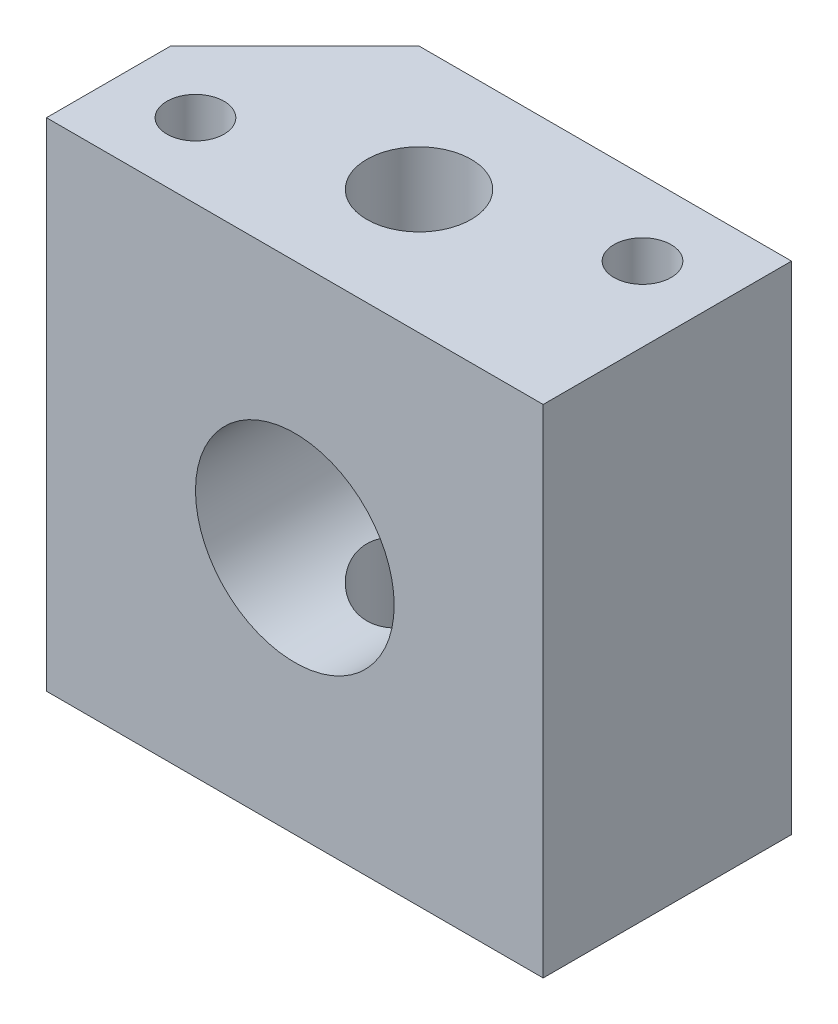
ISO-10303-21;
HEADER;
FILE_DESCRIPTION(('STEP AP214'),'2;1');
FILE_NAME('part.step','',(''),(''),'','','');
FILE_SCHEMA(('AUTOMOTIVE_DESIGN { 1 0 10303 214 1 1 1 1 }'));
ENDSEC;
DATA;
#1=APPLICATION_CONTEXT('core data for automotive mechanical design processes');
#2=APPLICATION_PROTOCOL_DEFINITION('international standard','automotive_design',2000,#1);
#3=PRODUCT_CONTEXT('',#1,'mechanical');
#4=PRODUCT('Part','Part','',(#3));
#5=PRODUCT_RELATED_PRODUCT_CATEGORY('part','',(#4));
#6=PRODUCT_DEFINITION_FORMATION('','',#4);
#7=PRODUCT_DEFINITION_CONTEXT('part definition',#1,'design');
#8=PRODUCT_DEFINITION('design','',#6,#7);
#9=PRODUCT_DEFINITION_SHAPE('','',#8);
#10=(LENGTH_UNIT() NAMED_UNIT(*) SI_UNIT(.MILLI.,.METRE.));
#11=(NAMED_UNIT(*) PLANE_ANGLE_UNIT() SI_UNIT($,.RADIAN.));
#12=(NAMED_UNIT(*) SI_UNIT($,.STERADIAN.) SOLID_ANGLE_UNIT());
#13=UNCERTAINTY_MEASURE_WITH_UNIT(LENGTH_MEASURE(1.E-05),#10,'distance_accuracy_value','');
#14=(GEOMETRIC_REPRESENTATION_CONTEXT(3) GLOBAL_UNCERTAINTY_ASSIGNED_CONTEXT((#13)) GLOBAL_UNIT_ASSIGNED_CONTEXT((#10,
#11,#12)) REPRESENTATION_CONTEXT('',''));
#15=CARTESIAN_POINT('',(0.,0.,0.));
#16=DIRECTION('',(0.,0.,1.));
#17=DIRECTION('',(1.,0.,0.));
#18=AXIS2_PLACEMENT_3D('',#15,#16,#17);
#19=CARTESIAN_POINT('',(0.,0.,10.));
#20=DIRECTION('',(0.,0.,-1.));
#21=DIRECTION('',(-1.,0.,0.));
#22=AXIS2_PLACEMENT_3D('',#19,#20,#21);
#23=PLANE('',#22);
#24=DIRECTION('',(0.,-1.,0.));
#25=VECTOR('',#24,1.);
#26=CARTESIAN_POINT('',(0.,0.,10.));
#27=LINE('',#26,#25);
#28=CARTESIAN_POINT('',(0.,20.,10.));
#29=VERTEX_POINT('',#28);
#30=CARTESIAN_POINT('',(0.,0.,10.));
#31=VERTEX_POINT('',#30);
#32=EDGE_CURVE('E94',#29,#31,#27,.T.);
#33=ORIENTED_EDGE('',*,*,#32,.T.);
#34=DIRECTION('',(1.,0.,0.));
#35=VECTOR('',#34,1.);
#36=CARTESIAN_POINT('',(0.,0.,10.));
#37=LINE('',#36,#35);
#38=CARTESIAN_POINT('',(20.,0.,10.));
#39=VERTEX_POINT('',#38);
#40=EDGE_CURVE('E83',#31,#39,#37,.T.);
#41=ORIENTED_EDGE('',*,*,#40,.T.);
#42=DIRECTION('',(0.,1.,0.));
#43=VECTOR('',#42,1.);
#44=CARTESIAN_POINT('',(20.,0.,10.));
#45=LINE('',#44,#43);
#46=CARTESIAN_POINT('',(20.,20.,10.));
#47=VERTEX_POINT('',#46);
#48=EDGE_CURVE('E93',#39,#47,#45,.T.);
#49=ORIENTED_EDGE('',*,*,#48,.T.);
#50=DIRECTION('',(-1.,0.,0.));
#51=VECTOR('',#50,1.);
#52=CARTESIAN_POINT('',(0.,20.,10.));
#53=LINE('',#52,#51);
#54=EDGE_CURVE('E99',#47,#29,#53,.T.);
#55=ORIENTED_EDGE('',*,*,#54,.T.);
#56=EDGE_LOOP('',(#33,#41,#49,#55));
#57=FACE_BOUND('',#56,.T.);
#58=CARTESIAN_POINT('',(10.,10.,10.));
#59=DIRECTION('',(0.,0.,1.));
#60=DIRECTION('',(1.,0.,0.));
#61=AXIS2_PLACEMENT_3D('',#58,#59,#60);
#62=CIRCLE('',#61,4.);
#63=CARTESIAN_POINT('',(14.,10.,10.));
#64=VERTEX_POINT('',#63);
#65=EDGE_CURVE('E275',#64,#64,#62,.T.);
#66=ORIENTED_EDGE('',*,*,#65,.F.);
#67=EDGE_LOOP('',(#66));
#68=FACE_BOUND('',#67,.T.);
#69=ADVANCED_FACE('F38',(#57,#68),#23,.F.);
#70=CARTESIAN_POINT('',(0.,0.,0.));
#71=DIRECTION('',(0.,0.,-1.));
#72=DIRECTION('',(-1.,0.,0.));
#73=AXIS2_PLACEMENT_3D('',#70,#71,#72);
#74=PLANE('',#73);
#75=DIRECTION('',(1.,0.,0.));
#76=VECTOR('',#75,1.);
#77=CARTESIAN_POINT('',(0.,0.,0.));
#78=LINE('',#77,#76);
#79=CARTESIAN_POINT('',(5.00000000000002,0.,0.));
#80=VERTEX_POINT('',#79);
#81=CARTESIAN_POINT('',(20.,0.,0.));
#82=VERTEX_POINT('',#81);
#83=EDGE_CURVE('E274',#80,#82,#78,.T.);
#84=ORIENTED_EDGE('',*,*,#83,.F.);
#85=DIRECTION('',(0.,1.,0.));
#86=VECTOR('',#85,1.);
#87=CARTESIAN_POINT('',(5.00000000000002,20.,0.));
#88=LINE('',#87,#86);
#89=CARTESIAN_POINT('',(5.00000000000002,20.,0.));
#90=VERTEX_POINT('',#89);
#91=EDGE_CURVE('E47',#80,#90,#88,.T.);
#92=ORIENTED_EDGE('',*,*,#91,.T.);
#93=DIRECTION('',(-1.,0.,0.));
#94=VECTOR('',#93,1.);
#95=CARTESIAN_POINT('',(0.,20.,0.));
#96=LINE('',#95,#94);
#97=CARTESIAN_POINT('',(20.,20.,0.));
#98=VERTEX_POINT('',#97);
#99=EDGE_CURVE('E104',#98,#90,#96,.T.);
#100=ORIENTED_EDGE('',*,*,#99,.F.);
#101=DIRECTION('',(0.,1.,0.));
#102=VECTOR('',#101,1.);
#103=CARTESIAN_POINT('',(20.,0.,0.));
#104=LINE('',#103,#102);
#105=EDGE_CURVE('E272',#82,#98,#104,.T.);
#106=ORIENTED_EDGE('',*,*,#105,.F.);
#107=EDGE_LOOP('',(#84,#92,#100,#106));
#108=FACE_BOUND('',#107,.T.);
#109=CARTESIAN_POINT('',(10.,10.,0.));
#110=DIRECTION('',(0.,0.,1.));
#111=DIRECTION('',(1.,0.,0.));
#112=AXIS2_PLACEMENT_3D('',#109,#110,#111);
#113=CIRCLE('',#112,4.);
#114=CARTESIAN_POINT('',(14.,10.,0.));
#115=VERTEX_POINT('',#114);
#116=EDGE_CURVE('E279',#115,#115,#113,.T.);
#117=ORIENTED_EDGE('',*,*,#116,.T.);
#118=EDGE_LOOP('',(#117));
#119=FACE_BOUND('',#118,.T.);
#120=ADVANCED_FACE('F158',(#108,#119),#74,.T.);
#121=CARTESIAN_POINT('',(0.,0.,10.));
#122=DIRECTION('',(1.,0.,0.));
#123=DIRECTION('',(0.,0.,-1.));
#124=AXIS2_PLACEMENT_3D('',#121,#122,#123);
#125=PLANE('',#124);
#126=DIRECTION('',(0.,0.,-1.));
#127=VECTOR('',#126,1.);
#128=CARTESIAN_POINT('',(0.,20.,10.));
#129=LINE('',#128,#127);
#130=CARTESIAN_POINT('',(0.,20.,5.));
#131=VERTEX_POINT('',#130);
#132=EDGE_CURVE('E260',#29,#131,#129,.T.);
#133=ORIENTED_EDGE('',*,*,#132,.T.);
#134=DIRECTION('',(0.,-1.,0.));
#135=VECTOR('',#134,1.);
#136=CARTESIAN_POINT('',(0.,0.,5.));
#137=LINE('',#136,#135);
#138=CARTESIAN_POINT('',(0.,0.,5.));
#139=VERTEX_POINT('',#138);
#140=EDGE_CURVE('E109',#131,#139,#137,.T.);
#141=ORIENTED_EDGE('',*,*,#140,.T.);
#142=DIRECTION('',(0.,0.,-1.));
#143=VECTOR('',#142,1.);
#144=CARTESIAN_POINT('',(0.,0.,10.));
#145=LINE('',#144,#143);
#146=EDGE_CURVE('E87',#31,#139,#145,.T.);
#147=ORIENTED_EDGE('',*,*,#146,.F.);
#148=ORIENTED_EDGE('',*,*,#32,.F.);
#149=EDGE_LOOP('',(#133,#141,#147,#148));
#150=FACE_BOUND('',#149,.T.);
#151=ADVANCED_FACE('F107',(#150),#125,.F.);
#152=CARTESIAN_POINT('',(0.,0.,10.));
#153=DIRECTION('',(0.,1.,0.));
#154=DIRECTION('',(0.,0.,1.));
#155=AXIS2_PLACEMENT_3D('',#152,#153,#154);
#156=PLANE('',#155);
#157=CARTESIAN_POINT('',(10.,0.,5.));
#158=DIRECTION('',(0.,1.,0.));
#159=DIRECTION('',(0.,0.,1.));
#160=AXIS2_PLACEMENT_3D('',#157,#158,#159);
#161=CIRCLE('',#160,2.1);
#162=CARTESIAN_POINT('',(10.,0.,7.1));
#163=VERTEX_POINT('',#162);
#164=EDGE_CURVE('E130',#163,#163,#161,.T.);
#165=ORIENTED_EDGE('',*,*,#164,.T.);
#166=EDGE_LOOP('',(#165));
#167=FACE_BOUND('',#166,.T.);
#168=CARTESIAN_POINT('',(17.,0.,3.));
#169=DIRECTION('',(0.,1.,0.));
#170=DIRECTION('',(0.,0.,1.));
#171=AXIS2_PLACEMENT_3D('',#168,#169,#170);
#172=CIRCLE('',#171,1.15);
#173=CARTESIAN_POINT('',(17.,0.,4.15));
#174=VERTEX_POINT('',#173);
#175=EDGE_CURVE('E291',#174,#174,#172,.T.);
#176=ORIENTED_EDGE('',*,*,#175,.T.);
#177=EDGE_LOOP('',(#176));
#178=FACE_BOUND('',#177,.T.);
#179=CARTESIAN_POINT('',(3.,0.,7.));
#180=DIRECTION('',(0.,1.,0.));
#181=DIRECTION('',(0.,0.,1.));
#182=AXIS2_PLACEMENT_3D('',#179,#180,#181);
#183=CIRCLE('',#182,1.15);
#184=CARTESIAN_POINT('',(3.,0.,8.15));
#185=VERTEX_POINT('',#184);
#186=EDGE_CURVE('E283',#185,#185,#183,.T.);
#187=ORIENTED_EDGE('',*,*,#186,.T.);
#188=EDGE_LOOP('',(#187));
#189=FACE_BOUND('',#188,.T.);
#190=ORIENTED_EDGE('',*,*,#146,.T.);
#191=DIRECTION('',(0.707106781186549,0.,-0.707106781186546));
#192=VECTOR('',#191,1.);
#193=CARTESIAN_POINT('',(0.,0.,5.));
#194=LINE('',#193,#192);
#195=EDGE_CURVE('E61',#139,#80,#194,.T.);
#196=ORIENTED_EDGE('',*,*,#195,.T.);
#197=ORIENTED_EDGE('',*,*,#83,.T.);
#198=DIRECTION('',(0.,0.,-1.));
#199=VECTOR('',#198,1.);
#200=CARTESIAN_POINT('',(20.,0.,10.));
#201=LINE('',#200,#199);
#202=EDGE_CURVE('E89',#39,#82,#201,.T.);
#203=ORIENTED_EDGE('',*,*,#202,.F.);
#204=ORIENTED_EDGE('',*,*,#40,.F.);
#205=EDGE_LOOP('',(#190,#196,#197,#203,#204));
#206=FACE_BOUND('',#205,.T.);
#207=ADVANCED_FACE('F85',(#167,#178,#189,#206),#156,.F.);
#208=CARTESIAN_POINT('',(20.,0.,10.));
#209=DIRECTION('',(-1.,0.,0.));
#210=DIRECTION('',(0.,0.,1.));
#211=AXIS2_PLACEMENT_3D('',#208,#209,#210);
#212=PLANE('',#211);
#213=ORIENTED_EDGE('',*,*,#105,.T.);
#214=DIRECTION('',(0.,0.,-1.));
#215=VECTOR('',#214,1.);
#216=CARTESIAN_POINT('',(20.,20.,10.));
#217=LINE('',#216,#215);
#218=EDGE_CURVE('E117',#47,#98,#217,.T.);
#219=ORIENTED_EDGE('',*,*,#218,.F.);
#220=ORIENTED_EDGE('',*,*,#48,.F.);
#221=ORIENTED_EDGE('',*,*,#202,.T.);
#222=EDGE_LOOP('',(#213,#219,#220,#221));
#223=FACE_BOUND('',#222,.T.);
#224=ADVANCED_FACE('F166',(#223),#212,.F.);
#225=CARTESIAN_POINT('',(0.,20.,10.));
#226=DIRECTION('',(0.,-1.,0.));
#227=DIRECTION('',(0.,0.,-1.));
#228=AXIS2_PLACEMENT_3D('',#225,#226,#227);
#229=PLANE('',#228);
#230=CARTESIAN_POINT('',(10.,20.,5.));
#231=DIRECTION('',(0.,1.,0.));
#232=DIRECTION('',(0.,0.,1.));
#233=AXIS2_PLACEMENT_3D('',#230,#231,#232);
#234=CIRCLE('',#233,2.1);
#235=CARTESIAN_POINT('',(10.,20.,7.1));
#236=VERTEX_POINT('',#235);
#237=EDGE_CURVE('E302',#236,#236,#234,.T.);
#238=ORIENTED_EDGE('',*,*,#237,.F.);
#239=EDGE_LOOP('',(#238));
#240=FACE_BOUND('',#239,.T.);
#241=CARTESIAN_POINT('',(17.,20.,3.));
#242=DIRECTION('',(0.,1.,0.));
#243=DIRECTION('',(0.,0.,1.));
#244=AXIS2_PLACEMENT_3D('',#241,#242,#243);
#245=CIRCLE('',#244,1.15);
#246=CARTESIAN_POINT('',(17.,20.,4.15));
#247=VERTEX_POINT('',#246);
#248=EDGE_CURVE('E295',#247,#247,#245,.T.);
#249=ORIENTED_EDGE('',*,*,#248,.F.);
#250=EDGE_LOOP('',(#249));
#251=FACE_BOUND('',#250,.T.);
#252=CARTESIAN_POINT('',(3.,20.,7.));
#253=DIRECTION('',(0.,1.,0.));
#254=DIRECTION('',(0.,0.,1.));
#255=AXIS2_PLACEMENT_3D('',#252,#253,#254);
#256=CIRCLE('',#255,1.15);
#257=CARTESIAN_POINT('',(3.,20.,8.15));
#258=VERTEX_POINT('',#257);
#259=EDGE_CURVE('E287',#258,#258,#256,.T.);
#260=ORIENTED_EDGE('',*,*,#259,.F.);
#261=EDGE_LOOP('',(#260));
#262=FACE_BOUND('',#261,.T.);
#263=ORIENTED_EDGE('',*,*,#99,.T.);
#264=DIRECTION('',(-0.707106781186549,0.,0.707106781186546));
#265=VECTOR('',#264,1.);
#266=CARTESIAN_POINT('',(0.,20.,5.));
#267=LINE('',#266,#265);
#268=EDGE_CURVE('E11',#90,#131,#267,.T.);
#269=ORIENTED_EDGE('',*,*,#268,.T.);
#270=ORIENTED_EDGE('',*,*,#132,.F.);
#271=ORIENTED_EDGE('',*,*,#54,.F.);
#272=ORIENTED_EDGE('',*,*,#218,.T.);
#273=EDGE_LOOP('',(#263,#269,#270,#271,#272));
#274=FACE_BOUND('',#273,.T.);
#275=ADVANCED_FACE('F153',(#240,#251,#262,#274),#229,.F.);
#276=CARTESIAN_POINT('',(10.,10.,10.));
#277=DIRECTION('',(0.,0.,-1.));
#278=DIRECTION('',(-1.,0.,0.));
#279=AXIS2_PLACEMENT_3D('',#276,#277,#278);
#280=CYLINDRICAL_SURFACE('',#279,4.);
#281=CARTESIAN_POINT('',(10.,6.,7.1));
#282=CARTESIAN_POINT('',(10.1097252395222,6.00000735712143,7.09999149182402));
#283=CARTESIAN_POINT('',(10.219566121798,6.00456264372183,7.09134922217854));
#284=CARTESIAN_POINT('',(10.4359563328533,6.02233943440273,7.05717948516372));
#285=CARTESIAN_POINT('',(10.5424999670262,6.03557514127012,7.03162434455593));
#286=CARTESIAN_POINT('',(10.7488477672566,6.06933643737892,6.96492682041999));
#287=CARTESIAN_POINT('',(10.848677088492,6.08983277838819,6.92384693196483));
#288=CARTESIAN_POINT('',(11.0398542926017,6.13627185166547,6.82761268027001));
#289=CARTESIAN_POINT('',(11.1312023073436,6.1622144992337,6.77245853590725));
#290=CARTESIAN_POINT('',(11.309471828917,6.21918036989897,6.64560480379001));
#291=CARTESIAN_POINT('',(11.395724279159,6.2504237366637,6.57306544943579));
#292=CARTESIAN_POINT('',(11.5554650500713,6.31381930334756,6.41532568390628));
#293=CARTESIAN_POINT('',(11.6289425654236,6.34597224613962,6.33011466668524));
#294=CARTESIAN_POINT('',(11.7675321072039,6.41082397725215,6.14052416418154));
#295=CARTESIAN_POINT('',(11.831345969498,6.44332348866761,6.03511911137417));
#296=CARTESIAN_POINT('',(11.940078009522,6.50144007791784,5.81322101259495));
#297=CARTESIAN_POINT('',(11.9850105598362,6.52706238534035,5.69673648353417));
#298=CARTESIAN_POINT('',(12.0516277897332,6.56601687704524,5.4632691019904));
#299=CARTESIAN_POINT('',(12.0745813337518,6.58001266877583,5.34676509569801));
#300=CARTESIAN_POINT('',(12.1004206577409,6.59581278015183,5.11079196134465));
#301=CARTESIAN_POINT('',(12.1033302560727,6.59763156974199,4.99132652193647));
#302=CARTESIAN_POINT('',(12.0899257568675,6.58939436861611,4.77023585900601));
#303=CARTESIAN_POINT('',(12.0761575200203,6.58091060350251,4.66838235315366));
#304=CARTESIAN_POINT('',(12.0342448200542,6.55581083424707,4.46871985136041));
#305=CARTESIAN_POINT('',(12.0060949114543,6.539191749845,4.37091240259461));
#306=CARTESIAN_POINT('',(11.9357620172503,6.49935982662122,4.17933944133553));
#307=CARTESIAN_POINT('',(11.8932738651597,6.476005360057,4.08571682638858));
#308=CARTESIAN_POINT('',(11.795716667553,6.42530822285815,3.90646125445991));
#309=CARTESIAN_POINT('',(11.7406420030435,6.39796377295332,3.82083189002303));
#310=CARTESIAN_POINT('',(11.6103939818052,6.33769555595972,3.64721957759017));
#311=CARTESIAN_POINT('',(11.5334784250171,6.30453027169095,3.5606227305343));
#312=CARTESIAN_POINT('',(11.3661646278118,6.23946073012832,3.40094507949334));
#313=CARTESIAN_POINT('',(11.2757586855825,6.20755720643637,3.32787205014572));
#314=CARTESIAN_POINT('',(11.07766804033,6.14643646739299,3.19341787931535));
#315=CARTESIAN_POINT('',(10.9692989194435,6.11747001525525,3.13292153118831));
#316=CARTESIAN_POINT('',(10.7420234421849,6.06771227404274,3.031537329285));
#317=CARTESIAN_POINT('',(10.6231263407839,6.04691389029545,2.99063245181349));
#318=CARTESIAN_POINT('',(10.3893969746267,6.0174126557382,2.93322732089385));
#319=CARTESIAN_POINT('',(10.2751308230942,6.00780492271699,2.9148930907168));
#320=CARTESIAN_POINT('',(10.0447608666751,5.99859330232608,2.89730685099086));
#321=CARTESIAN_POINT('',(9.9286581079261,5.99898391135607,2.89804434338993));
#322=CARTESIAN_POINT('',(9.70872092144702,6.0092327131638,2.91762725788288));
#323=CARTESIAN_POINT('',(9.60470032451397,6.01826140500287,2.93488622954967));
#324=CARTESIAN_POINT('',(9.40127181780377,6.04373452472691,2.98443875043909));
#325=CARTESIAN_POINT('',(9.30186439595728,6.06017973508651,3.01673388605335));
#326=CARTESIAN_POINT('',(9.10744667267227,6.09955778917673,3.09614425381873));
#327=CARTESIAN_POINT('',(9.01261796662089,6.12264823611772,3.14362307426731));
#328=CARTESIAN_POINT('',(8.83198843397269,6.17317896967193,3.25161917503482));
#329=CARTESIAN_POINT('',(8.74619124866934,6.20062099964834,3.312141684517));
#330=CARTESIAN_POINT('',(8.57644597835234,6.26069150054948,3.45183455389137));
#331=CARTESIAN_POINT('',(8.49364624763825,6.29356175470312,3.53229813881505));
#332=CARTESIAN_POINT('',(8.34215054537142,6.35879793581409,3.70585137885724));
#333=CARTESIAN_POINT('',(8.27346680544534,6.39116340311868,3.79895186895899));
#334=CARTESIAN_POINT('',(8.14802592286797,6.45381708724124,4.00233559015911));
#335=CARTESIAN_POINT('',(8.09227941578299,6.48384996522084,4.1133282356271));
#336=CARTESIAN_POINT('',(8.00083622566024,6.53501441698331,4.34516122596433));
#337=CARTESIAN_POINT('',(7.96511152583645,6.55615841867861,4.46598753776113));
#338=CARTESIAN_POINT('',(7.9182077120598,6.58432664261803,4.70149049526115));
#339=CARTESIAN_POINT('',(7.90496787202061,6.59253060297121,4.81561103123257));
#340=CARTESIAN_POINT('',(7.89735597501305,6.59721867481627,5.04469308443813));
#341=CARTESIAN_POINT('',(7.90297244647974,6.59370991195439,5.1596540479175));
#342=CARTESIAN_POINT('',(7.93094268033587,6.57666719939133,5.37316961432223));
#343=CARTESIAN_POINT('',(7.95130413421546,6.5643284893851,5.47209433551285));
#344=CARTESIAN_POINT('',(8.00554046552531,6.53256392015641,5.66496081401225));
#345=CARTESIAN_POINT('',(8.03942014323663,6.51313554362409,5.75890078781238));
#346=CARTESIAN_POINT('',(8.12217291990849,6.46784460498247,5.94599660125697));
#347=CARTESIAN_POINT('',(8.17188302793889,6.44164384863016,6.03869769157733));
#348=CARTESIAN_POINT('',(8.28402810851478,6.38622716980778,6.21506230921822));
#349=CARTESIAN_POINT('',(8.34646992511577,6.35700962982328,6.29872093850826));
#350=CARTESIAN_POINT('',(8.49243500638422,6.29400539338761,6.46672364713411));
#351=CARTESIAN_POINT('',(8.57768101319548,6.26014701561832,6.54955350976633));
#352=CARTESIAN_POINT('',(8.7616087291921,6.19527738709219,6.70015739194561));
#353=CARTESIAN_POINT('',(8.86029865553674,6.16426789718714,6.76792213623383));
#354=CARTESIAN_POINT('',(9.0712774135892,6.10775536569268,6.88743364904118));
#355=CARTESIAN_POINT('',(9.18379352536369,6.08237123529014,6.93884301060636));
#356=CARTESIAN_POINT('',(9.35889820048832,6.05126254272285,7.00070791315573));
#357=CARTESIAN_POINT('',(9.41828167895052,6.04205787823116,7.01878135698884));
#358=CARTESIAN_POINT('',(9.53872715481943,6.02622292348595,7.04965439112677));
#359=CARTESIAN_POINT('',(9.59978817571371,6.01959116815001,7.06245698304871));
#360=CARTESIAN_POINT('',(9.71722282280003,6.00961465038475,7.08164251076548));
#361=CARTESIAN_POINT('',(9.77349525398962,6.00601882824931,7.08851710911178));
#362=CARTESIAN_POINT('',(9.8865014673951,6.00120957667597,7.09769809925703));
#363=CARTESIAN_POINT('',(9.94323525862547,5.99999619390127,7.1000044015799));
#364=CARTESIAN_POINT('',(10.,6.,7.1));
#365=B_SPLINE_CURVE_WITH_KNOTS('',3,(#281,#282,#283,#284,#285,#286,#287,#288,#289,#290,#291,
#292,#293,#294,#295,#296,#297,#298,#299,#300,#301,#302,#303,#304,#305,#306,#307,#308,#309,#310,
#311,#312,#313,#314,#315,#316,#317,#318,#319,#320,#321,#322,#323,#324,#325,#326,#327,#328,#329,
#330,#331,#332,#333,#334,#335,#336,#337,#338,#339,#340,#341,#342,#343,#344,#345,#346,#347,#348,
#349,#350,#351,#352,#353,#354,#355,#356,#357,#358,#359,#360,#361,#362,#363,#364),.UNSPECIFIED.,
.T.,.F.,(4,2,2,2,2,2,2,2,2,2,2,2,2,2,2,2,2,2,2,2,2,2,2,2,2,2,2,2,2,2,2,2,2,2,2,2,2,2,2,2,2,4),
(0.,0.328955388056856,0.658450355809533,0.986632826787796,1.31481019432105,1.66422610127769,
2.01393612903032,2.3943054227538,2.77438464995628,3.13089429519635,3.48698022433373,
3.79492330354659,4.10298306894291,4.41806287071792,4.73328360921357,5.09317488258761,
5.4532724136417,5.83355153918037,6.21349962504739,6.55994297045685,6.90619561978194,
7.22222027001752,7.53827827001649,7.86255611827312,8.18696421086294,8.54557019619715,
8.90448561862087,9.28577946390602,9.66653841880978,10.0100186118085,10.3532898805348,
10.6572136356427,10.9612454093544,11.2851996834104,11.6093285635883,11.9784125341219,
12.3477231159961,12.7242211787441,12.9122308814787,13.1001333688401,13.270310275105,
13.4404905144749),.UNSPECIFIED.);
#366=CARTESIAN_POINT('',(10.,6.,7.1));
#367=VERTEX_POINT('',#366);
#368=EDGE_CURVE('E129',#367,#367,#365,.T.);
#369=ORIENTED_EDGE('',*,*,#368,.F.);
#370=EDGE_LOOP('',(#369));
#371=FACE_BOUND('',#370,.T.);
#372=CARTESIAN_POINT('',(10.,14.,7.1));
#373=CARTESIAN_POINT('',(9.89027476047782,13.9999926428786,7.09999149182402));
#374=CARTESIAN_POINT('',(9.78043387820201,13.9954373562782,7.09134922217854));
#375=CARTESIAN_POINT('',(9.5640436671467,13.9776605655973,7.05717948516372));
#376=CARTESIAN_POINT('',(9.45750003297383,13.9644248587299,7.03162434455593));
#377=CARTESIAN_POINT('',(9.25115223274336,13.9306635626211,6.96492682041999));
#378=CARTESIAN_POINT('',(9.15132291150798,13.9101672216118,6.92384693196483));
#379=CARTESIAN_POINT('',(8.9601457073983,13.8637281483345,6.82761268027001));
#380=CARTESIAN_POINT('',(8.86879769265641,13.8377855007663,6.77245853590725));
#381=CARTESIAN_POINT('',(8.69052817108305,13.780819630101,6.64560480379001));
#382=CARTESIAN_POINT('',(8.60427572084105,13.7495762633363,6.57306544943579));
#383=CARTESIAN_POINT('',(8.44453494992872,13.6861806966524,6.41532568390628));
#384=CARTESIAN_POINT('',(8.37105743457642,13.6540277538604,6.33011466668524));
#385=CARTESIAN_POINT('',(8.23246789279613,13.5891760227479,6.14052416418154));
#386=CARTESIAN_POINT('',(8.16865403050204,13.5566765113324,6.03511911137417));
#387=CARTESIAN_POINT('',(8.059921990478,13.4985599220822,5.81322101259495));
#388=CARTESIAN_POINT('',(8.01498944016383,13.4729376146597,5.69673648353417));
#389=CARTESIAN_POINT('',(7.94837221026677,13.4339831229548,5.4632691019904));
#390=CARTESIAN_POINT('',(7.92541866624817,13.4199873312242,5.34676509569802));
#391=CARTESIAN_POINT('',(7.8995793422591,13.4041872198482,5.11079196134465));
#392=CARTESIAN_POINT('',(7.89666974392728,13.402368430258,4.99132652193647));
#393=CARTESIAN_POINT('',(7.91007424313252,13.4106056313839,4.77023585900601));
#394=CARTESIAN_POINT('',(7.92384247997974,13.4190893964975,4.66838235315366));
#395=CARTESIAN_POINT('',(7.96575517994578,13.4441891657529,4.46871985136041));
#396=CARTESIAN_POINT('',(7.99390508854568,13.460808250155,4.37091240259461));
#397=CARTESIAN_POINT('',(8.06423798274965,13.5006401733788,4.17933944133553));
#398=CARTESIAN_POINT('',(8.10672613484033,13.523994639943,4.08571682638858));
#399=CARTESIAN_POINT('',(8.20428333244702,13.5746917771419,3.90646125445991));
#400=CARTESIAN_POINT('',(8.25935799695647,13.6020362270467,3.82083189002303));
#401=CARTESIAN_POINT('',(8.38960601819478,13.6623044440403,3.64721957759017));
#402=CARTESIAN_POINT('',(8.46652157498293,13.6954697283091,3.5606227305343));
#403=CARTESIAN_POINT('',(8.63383537218824,13.7605392698717,3.40094507949334));
#404=CARTESIAN_POINT('',(8.72424131441753,13.7924427935636,3.32787205014572));
#405=CARTESIAN_POINT('',(8.92233195967002,13.853563532607,3.19341787931535));
#406=CARTESIAN_POINT('',(9.0307010805565,13.8825299847447,3.13292153118831));
#407=CARTESIAN_POINT('',(9.25797655781514,13.9322877259573,3.031537329285));
#408=CARTESIAN_POINT('',(9.37687365921613,13.9530861097046,2.99063245181349));
#409=CARTESIAN_POINT('',(9.61060302537331,13.9825873442618,2.93322732089385));
#410=CARTESIAN_POINT('',(9.72486917690578,13.992195077283,2.9148930907168));
#411=CARTESIAN_POINT('',(9.95523913332491,14.0014066976739,2.89730685099086));
#412=CARTESIAN_POINT('',(10.0713418920739,14.0010160886439,2.89804434338993));
#413=CARTESIAN_POINT('',(10.291279078553,13.9907672868362,2.91762725788288));
#414=CARTESIAN_POINT('',(10.395299675486,13.9817385949971,2.93488622954967));
#415=CARTESIAN_POINT('',(10.5987281821962,13.9562654752731,2.98443875043909));
#416=CARTESIAN_POINT('',(10.6981356040427,13.9398202649135,3.01673388605335));
#417=CARTESIAN_POINT('',(10.8925533273277,13.9004422108233,3.09614425381873));
#418=CARTESIAN_POINT('',(10.9873820333791,13.8773517638823,3.14362307426731));
#419=CARTESIAN_POINT('',(11.1680115660273,13.8268210303281,3.25161917503482));
#420=CARTESIAN_POINT('',(11.2538087513307,13.7993790003517,3.312141684517));
#421=CARTESIAN_POINT('',(11.4235540216477,13.7393084994505,3.45183455389137));
#422=CARTESIAN_POINT('',(11.5063537523618,13.7064382452969,3.53229813881505));
#423=CARTESIAN_POINT('',(11.6578494546286,13.6412020641859,3.70585137885723));
#424=CARTESIAN_POINT('',(11.7265331945547,13.6088365968813,3.79895186895899));
#425=CARTESIAN_POINT('',(11.851974077132,13.5461829127588,4.00233559015911));
#426=CARTESIAN_POINT('',(11.907720584217,13.5161500347792,4.1133282356271));
#427=CARTESIAN_POINT('',(11.9991637743398,13.4649855830167,4.34516122596433));
#428=CARTESIAN_POINT('',(12.0348884741635,13.4438415813214,4.46598753776113));
#429=CARTESIAN_POINT('',(12.0817922879402,13.415673357382,4.70149049526115));
#430=CARTESIAN_POINT('',(12.0950321279794,13.4074693970288,4.81561103123257));
#431=CARTESIAN_POINT('',(12.102644024987,13.4027813251837,5.04469308443813));
#432=CARTESIAN_POINT('',(12.0970275535203,13.4062900880456,5.1596540479175));
#433=CARTESIAN_POINT('',(12.0690573196641,13.4233328006087,5.37316961432223));
#434=CARTESIAN_POINT('',(12.0486958657845,13.4356715106149,5.47209433551285));
#435=CARTESIAN_POINT('',(11.9944595344747,13.4674360798436,5.66496081401225));
#436=CARTESIAN_POINT('',(11.9605798567634,13.4868644563759,5.75890078781238));
#437=CARTESIAN_POINT('',(11.8778270800915,13.5321553950175,5.94599660125697));
#438=CARTESIAN_POINT('',(11.8281169720611,13.5583561513698,6.03869769157733));
#439=CARTESIAN_POINT('',(11.7159718914852,13.6137728301922,6.21506230921822));
#440=CARTESIAN_POINT('',(11.6535300748842,13.6429903701767,6.29872093850826));
#441=CARTESIAN_POINT('',(11.5075649936158,13.7059946066124,6.46672364713411));
#442=CARTESIAN_POINT('',(11.4223189868045,13.7398529843817,6.54955350976633));
#443=CARTESIAN_POINT('',(11.2383912708079,13.8047226129078,6.70015739194561));
#444=CARTESIAN_POINT('',(11.1397013444633,13.8357321028129,6.76792213623383));
#445=CARTESIAN_POINT('',(10.9287225864108,13.8922446343073,6.88743364904118));
#446=CARTESIAN_POINT('',(10.8162064746363,13.9176287647099,6.93884301060636));
#447=CARTESIAN_POINT('',(10.6411017995117,13.9487374572772,7.00070791315574));
#448=CARTESIAN_POINT('',(10.5817183210495,13.9579421217688,7.01878135698884));
#449=CARTESIAN_POINT('',(10.4612728451806,13.973777076514,7.04965439112677));
#450=CARTESIAN_POINT('',(10.4002118242863,13.98040883185,7.06245698304871));
#451=CARTESIAN_POINT('',(10.2827771772,13.9903853496153,7.08164251076548));
#452=CARTESIAN_POINT('',(10.2265047460104,13.9939811717507,7.08851710911178));
#453=CARTESIAN_POINT('',(10.1134985326049,13.998790423324,7.09769809925703));
#454=CARTESIAN_POINT('',(10.0567647413745,14.0000038060987,7.1000044015799));
#455=CARTESIAN_POINT('',(10.,14.,7.1));
#456=B_SPLINE_CURVE_WITH_KNOTS('',3,(#372,#373,#374,#375,#376,#377,#378,#379,#380,#381,#382,
#383,#384,#385,#386,#387,#388,#389,#390,#391,#392,#393,#394,#395,#396,#397,#398,#399,#400,#401,
#402,#403,#404,#405,#406,#407,#408,#409,#410,#411,#412,#413,#414,#415,#416,#417,#418,#419,#420,
#421,#422,#423,#424,#425,#426,#427,#428,#429,#430,#431,#432,#433,#434,#435,#436,#437,#438,#439,
#440,#441,#442,#443,#444,#445,#446,#447,#448,#449,#450,#451,#452,#453,#454,#455),.UNSPECIFIED.,
.T.,.F.,(4,2,2,2,2,2,2,2,2,2,2,2,2,2,2,2,2,2,2,2,2,2,2,2,2,2,2,2,2,2,2,2,2,2,2,2,2,2,2,2,2,4),
(0.,0.328955388056856,0.658450355809533,0.986632826787796,1.31481019432105,1.66422610127769,
2.01393612903032,2.3943054227538,2.77438464995628,3.13089429519635,3.48698022433372,
3.79492330354659,4.10298306894291,4.41806287071792,4.73328360921357,5.09317488258761,
5.4532724136417,5.83355153918037,6.21349962504739,6.55994297045685,6.90619561978194,
7.22222027001752,7.53827827001649,7.86255611827312,8.18696421086294,8.54557019619715,
8.90448561862087,9.28577946390602,9.66653841880978,10.0100186118085,10.3532898805348,
10.6572136356427,10.9612454093544,11.2851996834104,11.6093285635883,11.9784125341219,
12.3477231159961,12.7242211787441,12.9122308814787,13.1001333688401,13.270310275105,
13.4404905144749),.UNSPECIFIED.);
#457=CARTESIAN_POINT('',(10.,14.,7.1));
#458=VERTEX_POINT('',#457);
#459=EDGE_CURVE('E121',#458,#458,#456,.T.);
#460=ORIENTED_EDGE('',*,*,#459,.F.);
#461=EDGE_LOOP('',(#460));
#462=FACE_BOUND('',#461,.T.);
#463=ORIENTED_EDGE('',*,*,#65,.T.);
#464=EDGE_LOOP('',(#463));
#465=FACE_BOUND('',#464,.T.);
#466=ORIENTED_EDGE('',*,*,#116,.F.);
#467=EDGE_LOOP('',(#466));
#468=FACE_BOUND('',#467,.T.);
#469=ADVANCED_FACE('F133',(#371,#462,#465,#468),#280,.F.);
#470=CARTESIAN_POINT('',(3.,0.,7.));
#471=DIRECTION('',(0.,1.,0.));
#472=DIRECTION('',(0.,0.,1.));
#473=AXIS2_PLACEMENT_3D('',#470,#471,#472);
#474=CYLINDRICAL_SURFACE('',#473,1.15);
#475=ORIENTED_EDGE('',*,*,#186,.F.);
#476=EDGE_LOOP('',(#475));
#477=FACE_BOUND('',#476,.T.);
#478=ORIENTED_EDGE('',*,*,#259,.T.);
#479=EDGE_LOOP('',(#478));
#480=FACE_BOUND('',#479,.T.);
#481=ADVANCED_FACE('F146',(#477,#480),#474,.F.);
#482=CARTESIAN_POINT('',(17.,0.,3.));
#483=DIRECTION('',(0.,1.,0.));
#484=DIRECTION('',(0.,0.,1.));
#485=AXIS2_PLACEMENT_3D('',#482,#483,#484);
#486=CYLINDRICAL_SURFACE('',#485,1.15);
#487=ORIENTED_EDGE('',*,*,#175,.F.);
#488=EDGE_LOOP('',(#487));
#489=FACE_BOUND('',#488,.T.);
#490=ORIENTED_EDGE('',*,*,#248,.T.);
#491=EDGE_LOOP('',(#490));
#492=FACE_BOUND('',#491,.T.);
#493=ADVANCED_FACE('F142',(#489,#492),#486,.F.);
#494=CARTESIAN_POINT('',(10.,0.,5.));
#495=DIRECTION('',(0.,1.,0.));
#496=DIRECTION('',(0.,0.,1.));
#497=AXIS2_PLACEMENT_3D('',#494,#495,#496);
#498=CYLINDRICAL_SURFACE('',#497,2.1);
#499=ORIENTED_EDGE('',*,*,#459,.T.);
#500=EDGE_LOOP('',(#499));
#501=FACE_BOUND('',#500,.T.);
#502=ORIENTED_EDGE('',*,*,#237,.T.);
#503=EDGE_LOOP('',(#502));
#504=FACE_BOUND('',#503,.T.);
#505=ADVANCED_FACE('F137',(#501,#504),#498,.F.);
#506=ORIENTED_EDGE('',*,*,#368,.T.);
#507=EDGE_LOOP('',(#506));
#508=FACE_BOUND('',#507,.T.);
#509=ORIENTED_EDGE('',*,*,#164,.F.);
#510=EDGE_LOOP('',(#509));
#511=FACE_BOUND('',#510,.T.);
#512=ADVANCED_FACE('F141',(#508,#511),#498,.F.);
#513=CARTESIAN_POINT('',(0.,0.,5.));
#514=DIRECTION('',(-0.707106781186546,0.,-0.707106781186549));
#515=DIRECTION('',(0.,1.,0.));
#516=AXIS2_PLACEMENT_3D('',#513,#514,#515);
#517=PLANE('',#516);
#518=ORIENTED_EDGE('',*,*,#268,.F.);
#519=ORIENTED_EDGE('',*,*,#91,.F.);
#520=ORIENTED_EDGE('',*,*,#195,.F.);
#521=ORIENTED_EDGE('',*,*,#140,.F.);
#522=EDGE_LOOP('',(#518,#519,#520,#521));
#523=FACE_BOUND('',#522,.T.);
#524=ADVANCED_FACE('F40',(#523),#517,.T.);
#525=CLOSED_SHELL('',(#69,#120,#151,#207,#224,#275,#469,#481,#493,#505,#512,#524));
#526=MANIFOLD_SOLID_BREP('B2',#525);
#527=ADVANCED_BREP_SHAPE_REPRESENTATION('',(#18,#526),#14);
#528=SHAPE_DEFINITION_REPRESENTATION(#9,#527);
ENDSEC;
END-ISO-10303-21;
